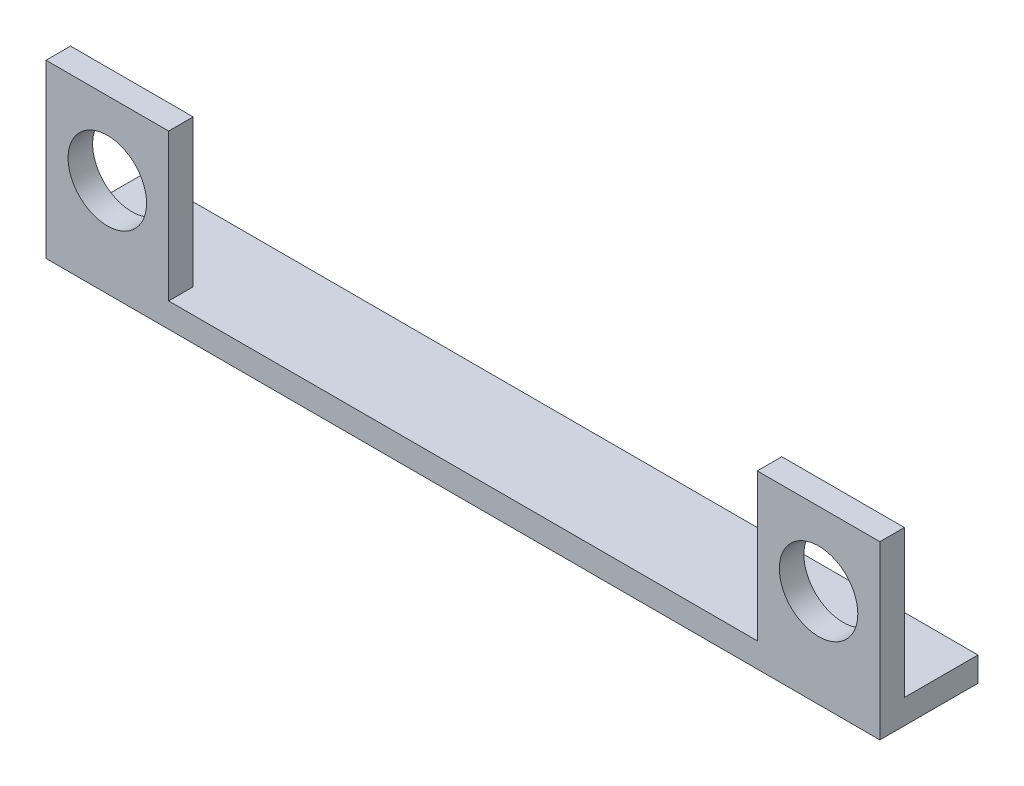
ISO-10303-21;
HEADER;
FILE_DESCRIPTION(('STEP AP214'),'2;1');
FILE_NAME('part.step','',(''),(''),'','','');
FILE_SCHEMA(('AUTOMOTIVE_DESIGN { 1 0 10303 214 1 1 1 1 }'));
ENDSEC;
DATA;
#1=APPLICATION_CONTEXT('core data for automotive mechanical design processes');
#2=APPLICATION_PROTOCOL_DEFINITION('international standard','automotive_design',2000,#1);
#3=PRODUCT_CONTEXT('',#1,'mechanical');
#4=PRODUCT('Part','Part','',(#3));
#5=PRODUCT_RELATED_PRODUCT_CATEGORY('part','',(#4));
#6=PRODUCT_DEFINITION_FORMATION('','',#4);
#7=PRODUCT_DEFINITION_CONTEXT('part definition',#1,'design');
#8=PRODUCT_DEFINITION('design','',#6,#7);
#9=PRODUCT_DEFINITION_SHAPE('','',#8);
#10=(LENGTH_UNIT() NAMED_UNIT(*) SI_UNIT(.MILLI.,.METRE.));
#11=(NAMED_UNIT(*) PLANE_ANGLE_UNIT() SI_UNIT($,.RADIAN.));
#12=(NAMED_UNIT(*) SI_UNIT($,.STERADIAN.) SOLID_ANGLE_UNIT());
#13=UNCERTAINTY_MEASURE_WITH_UNIT(LENGTH_MEASURE(1.E-05),#10,'distance_accuracy_value','');
#14=(GEOMETRIC_REPRESENTATION_CONTEXT(3) GLOBAL_UNCERTAINTY_ASSIGNED_CONTEXT((#13)) GLOBAL_UNIT_ASSIGNED_CONTEXT((#10,
#11,#12)) REPRESENTATION_CONTEXT('',''));
#15=CARTESIAN_POINT('',(0.,0.,0.));
#16=DIRECTION('',(0.,0.,1.));
#17=DIRECTION('',(1.,0.,0.));
#18=AXIS2_PLACEMENT_3D('',#15,#16,#17);
#19=CARTESIAN_POINT('',(0.,1.,0.));
#20=DIRECTION('',(0.,1.,0.));
#21=DIRECTION('',(0.,0.,1.));
#22=AXIS2_PLACEMENT_3D('',#19,#20,#21);
#23=PLANE('',#22);
#24=DIRECTION('',(0.,0.,1.));
#25=VECTOR('',#24,1.);
#26=CARTESIAN_POINT('',(12.,1.,2.));
#27=LINE('',#26,#25);
#28=CARTESIAN_POINT('',(12.,1.,1.));
#29=VERTEX_POINT('',#28);
#30=CARTESIAN_POINT('',(12.,1.,2.));
#31=VERTEX_POINT('',#30);
#32=EDGE_CURVE('E54',#29,#31,#27,.T.);
#33=ORIENTED_EDGE('',*,*,#32,.F.);
#34=DIRECTION('',(-1.,0.,0.));
#35=VECTOR('',#34,1.);
#36=CARTESIAN_POINT('',(17.,1.,1.));
#37=LINE('',#36,#35);
#38=CARTESIAN_POINT('',(17.,1.,1.));
#39=VERTEX_POINT('',#38);
#40=EDGE_CURVE('E58',#39,#29,#37,.T.);
#41=ORIENTED_EDGE('',*,*,#40,.F.);
#42=DIRECTION('',(0.,0.,-1.));
#43=VECTOR('',#42,1.);
#44=CARTESIAN_POINT('',(17.,1.,-2.));
#45=LINE('',#44,#43);
#46=CARTESIAN_POINT('',(17.,1.,-2.));
#47=VERTEX_POINT('',#46);
#48=EDGE_CURVE('E173',#39,#47,#45,.T.);
#49=ORIENTED_EDGE('',*,*,#48,.T.);
#50=DIRECTION('',(-1.,0.,0.));
#51=VECTOR('',#50,1.);
#52=CARTESIAN_POINT('',(-17.,1.,-2.));
#53=LINE('',#52,#51);
#54=CARTESIAN_POINT('',(-17.,1.,-2.));
#55=VERTEX_POINT('',#54);
#56=EDGE_CURVE('E175',#47,#55,#53,.T.);
#57=ORIENTED_EDGE('',*,*,#56,.T.);
#58=DIRECTION('',(0.,0.,1.));
#59=VECTOR('',#58,1.);
#60=CARTESIAN_POINT('',(-17.,1.,-2.));
#61=LINE('',#60,#59);
#62=CARTESIAN_POINT('',(-17.,1.,1.));
#63=VERTEX_POINT('',#62);
#64=EDGE_CURVE('E168',#55,#63,#61,.T.);
#65=ORIENTED_EDGE('',*,*,#64,.T.);
#66=DIRECTION('',(-1.,0.,0.));
#67=VECTOR('',#66,1.);
#68=CARTESIAN_POINT('',(-17.,1.,1.));
#69=LINE('',#68,#67);
#70=CARTESIAN_POINT('',(-12.,1.,1.));
#71=VERTEX_POINT('',#70);
#72=EDGE_CURVE('E147',#71,#63,#69,.T.);
#73=ORIENTED_EDGE('',*,*,#72,.F.);
#74=DIRECTION('',(0.,0.,-1.));
#75=VECTOR('',#74,1.);
#76=CARTESIAN_POINT('',(-12.,1.,2.));
#77=LINE('',#76,#75);
#78=CARTESIAN_POINT('',(-12.,1.,2.));
#79=VERTEX_POINT('',#78);
#80=EDGE_CURVE('E154',#79,#71,#77,.T.);
#81=ORIENTED_EDGE('',*,*,#80,.F.);
#82=DIRECTION('',(1.,0.,0.));
#83=VECTOR('',#82,1.);
#84=CARTESIAN_POINT('',(-17.,1.,2.));
#85=LINE('',#84,#83);
#86=EDGE_CURVE('E170',#79,#31,#85,.T.);
#87=ORIENTED_EDGE('',*,*,#86,.T.);
#88=EDGE_LOOP('',(#33,#41,#49,#57,#65,#73,#81,#87));
#89=FACE_BOUND('',#88,.T.);
#90=ADVANCED_FACE('F37',(#89),#23,.T.);
#91=CARTESIAN_POINT('',(-17.,1.,-2.));
#92=DIRECTION('',(1.,0.,0.));
#93=DIRECTION('',(0.,0.,-1.));
#94=AXIS2_PLACEMENT_3D('',#91,#92,#93);
#95=PLANE('',#94);
#96=DIRECTION('',(0.,0.,1.));
#97=VECTOR('',#96,1.);
#98=CARTESIAN_POINT('',(-17.,0.,-2.));
#99=LINE('',#98,#97);
#100=CARTESIAN_POINT('',(-17.,0.,-2.));
#101=VERTEX_POINT('',#100);
#102=CARTESIAN_POINT('',(-17.,0.,2.));
#103=VERTEX_POINT('',#102);
#104=EDGE_CURVE('E167',#101,#103,#99,.T.);
#105=ORIENTED_EDGE('',*,*,#104,.T.);
#106=DIRECTION('',(0.,-1.,0.));
#107=VECTOR('',#106,1.);
#108=CARTESIAN_POINT('',(-17.,1.,2.));
#109=LINE('',#108,#107);
#110=CARTESIAN_POINT('',(-17.,7.,2.));
#111=VERTEX_POINT('',#110);
#112=EDGE_CURVE('E11',#111,#103,#109,.T.);
#113=ORIENTED_EDGE('',*,*,#112,.F.);
#114=DIRECTION('',(0.,0.,1.));
#115=VECTOR('',#114,1.);
#116=CARTESIAN_POINT('',(-17.,7.,2.));
#117=LINE('',#116,#115);
#118=CARTESIAN_POINT('',(-17.,7.,1.));
#119=VERTEX_POINT('',#118);
#120=EDGE_CURVE('E143',#119,#111,#117,.T.);
#121=ORIENTED_EDGE('',*,*,#120,.F.);
#122=DIRECTION('',(0.,-1.,0.));
#123=VECTOR('',#122,1.);
#124=CARTESIAN_POINT('',(-17.,7.,1.));
#125=LINE('',#124,#123);
#126=EDGE_CURVE('E153',#119,#63,#125,.T.);
#127=ORIENTED_EDGE('',*,*,#126,.T.);
#128=ORIENTED_EDGE('',*,*,#64,.F.);
#129=DIRECTION('',(0.,-1.,0.));
#130=VECTOR('',#129,1.);
#131=CARTESIAN_POINT('',(-17.,1.,-2.));
#132=LINE('',#131,#130);
#133=EDGE_CURVE('E177',#55,#101,#132,.T.);
#134=ORIENTED_EDGE('',*,*,#133,.T.);
#135=EDGE_LOOP('',(#105,#113,#121,#127,#128,#134));
#136=FACE_BOUND('',#135,.T.);
#137=ADVANCED_FACE('F39',(#136),#95,.F.);
#138=CARTESIAN_POINT('',(-17.,1.,2.));
#139=DIRECTION('',(0.,0.,-1.));
#140=DIRECTION('',(-1.,0.,0.));
#141=AXIS2_PLACEMENT_3D('',#138,#139,#140);
#142=PLANE('',#141);
#143=CARTESIAN_POINT('',(-14.5,4.,2.));
#144=DIRECTION('',(0.,0.,1.));
#145=DIRECTION('',(1.,0.,0.));
#146=AXIS2_PLACEMENT_3D('',#143,#144,#145);
#147=CIRCLE('',#146,1.6);
#148=CARTESIAN_POINT('',(-12.9,4.,2.));
#149=VERTEX_POINT('',#148);
#150=EDGE_CURVE('E189',#149,#149,#147,.T.);
#151=ORIENTED_EDGE('',*,*,#150,.F.);
#152=EDGE_LOOP('',(#151));
#153=FACE_BOUND('',#152,.T.);
#154=CARTESIAN_POINT('',(14.5,4.,2.));
#155=DIRECTION('',(0.,0.,1.));
#156=DIRECTION('',(1.,0.,0.));
#157=AXIS2_PLACEMENT_3D('',#154,#155,#156);
#158=CIRCLE('',#157,1.6);
#159=CARTESIAN_POINT('',(16.1,4.,2.));
#160=VERTEX_POINT('',#159);
#161=EDGE_CURVE('E194',#160,#160,#158,.T.);
#162=ORIENTED_EDGE('',*,*,#161,.F.);
#163=EDGE_LOOP('',(#162));
#164=FACE_BOUND('',#163,.T.);
#165=DIRECTION('',(1.,0.,0.));
#166=VECTOR('',#165,1.);
#167=CARTESIAN_POINT('',(-17.,0.,2.));
#168=LINE('',#167,#166);
#169=CARTESIAN_POINT('',(17.,0.,2.));
#170=VERTEX_POINT('',#169);
#171=EDGE_CURVE('E118',#103,#170,#168,.T.);
#172=ORIENTED_EDGE('',*,*,#171,.T.);
#173=DIRECTION('',(0.,-1.,0.));
#174=VECTOR('',#173,1.);
#175=CARTESIAN_POINT('',(17.,1.,2.));
#176=LINE('',#175,#174);
#177=CARTESIAN_POINT('',(17.,7.,2.));
#178=VERTEX_POINT('',#177);
#179=EDGE_CURVE('E46',#178,#170,#176,.T.);
#180=ORIENTED_EDGE('',*,*,#179,.F.);
#181=DIRECTION('',(1.,0.,0.));
#182=VECTOR('',#181,1.);
#183=CARTESIAN_POINT('',(17.,7.,2.));
#184=LINE('',#183,#182);
#185=CARTESIAN_POINT('',(12.,7.,2.));
#186=VERTEX_POINT('',#185);
#187=EDGE_CURVE('E117',#186,#178,#184,.T.);
#188=ORIENTED_EDGE('',*,*,#187,.F.);
#189=DIRECTION('',(0.,-1.,0.));
#190=VECTOR('',#189,1.);
#191=CARTESIAN_POINT('',(12.,7.,2.));
#192=LINE('',#191,#190);
#193=EDGE_CURVE('E132',#186,#31,#192,.T.);
#194=ORIENTED_EDGE('',*,*,#193,.T.);
#195=ORIENTED_EDGE('',*,*,#86,.F.);
#196=DIRECTION('',(0.,-1.,0.));
#197=VECTOR('',#196,1.);
#198=CARTESIAN_POINT('',(-12.,7.,2.));
#199=LINE('',#198,#197);
#200=CARTESIAN_POINT('',(-12.,7.,2.));
#201=VERTEX_POINT('',#200);
#202=EDGE_CURVE('E164',#201,#79,#199,.T.);
#203=ORIENTED_EDGE('',*,*,#202,.F.);
#204=DIRECTION('',(1.,0.,0.));
#205=VECTOR('',#204,1.);
#206=CARTESIAN_POINT('',(-17.,7.,2.));
#207=LINE('',#206,#205);
#208=EDGE_CURVE('E146',#111,#201,#207,.T.);
#209=ORIENTED_EDGE('',*,*,#208,.F.);
#210=ORIENTED_EDGE('',*,*,#112,.T.);
#211=EDGE_LOOP('',(#172,#180,#188,#194,#195,#203,#209,#210));
#212=FACE_BOUND('',#211,.T.);
#213=ADVANCED_FACE('F115',(#153,#164,#212),#142,.F.);
#214=CARTESIAN_POINT('',(17.,1.,-2.));
#215=DIRECTION('',(-1.,0.,0.));
#216=DIRECTION('',(0.,0.,1.));
#217=AXIS2_PLACEMENT_3D('',#214,#215,#216);
#218=PLANE('',#217);
#219=DIRECTION('',(0.,0.,-1.));
#220=VECTOR('',#219,1.);
#221=CARTESIAN_POINT('',(17.,0.,-2.));
#222=LINE('',#221,#220);
#223=CARTESIAN_POINT('',(17.,0.,-2.));
#224=VERTEX_POINT('',#223);
#225=EDGE_CURVE('E181',#170,#224,#222,.T.);
#226=ORIENTED_EDGE('',*,*,#225,.T.);
#227=DIRECTION('',(0.,-1.,0.));
#228=VECTOR('',#227,1.);
#229=CARTESIAN_POINT('',(17.,1.,-2.));
#230=LINE('',#229,#228);
#231=EDGE_CURVE('E122',#47,#224,#230,.T.);
#232=ORIENTED_EDGE('',*,*,#231,.F.);
#233=ORIENTED_EDGE('',*,*,#48,.F.);
#234=DIRECTION('',(0.,-1.,0.));
#235=VECTOR('',#234,1.);
#236=CARTESIAN_POINT('',(17.,7.,1.));
#237=LINE('',#236,#235);
#238=CARTESIAN_POINT('',(17.,7.,1.));
#239=VERTEX_POINT('',#238);
#240=EDGE_CURVE('E136',#239,#39,#237,.T.);
#241=ORIENTED_EDGE('',*,*,#240,.F.);
#242=DIRECTION('',(0.,0.,-1.));
#243=VECTOR('',#242,1.);
#244=CARTESIAN_POINT('',(17.,7.,2.));
#245=LINE('',#244,#243);
#246=EDGE_CURVE('E127',#178,#239,#245,.T.);
#247=ORIENTED_EDGE('',*,*,#246,.F.);
#248=ORIENTED_EDGE('',*,*,#179,.T.);
#249=EDGE_LOOP('',(#226,#232,#233,#241,#247,#248));
#250=FACE_BOUND('',#249,.T.);
#251=ADVANCED_FACE('F134',(#250),#218,.F.);
#252=CARTESIAN_POINT('',(-17.,1.,-2.));
#253=DIRECTION('',(0.,0.,1.));
#254=DIRECTION('',(1.,0.,0.));
#255=AXIS2_PLACEMENT_3D('',#252,#253,#254);
#256=PLANE('',#255);
#257=DIRECTION('',(-1.,0.,0.));
#258=VECTOR('',#257,1.);
#259=CARTESIAN_POINT('',(-17.,0.,-2.));
#260=LINE('',#259,#258);
#261=EDGE_CURVE('E171',#224,#101,#260,.T.);
#262=ORIENTED_EDGE('',*,*,#261,.T.);
#263=ORIENTED_EDGE('',*,*,#133,.F.);
#264=ORIENTED_EDGE('',*,*,#56,.F.);
#265=ORIENTED_EDGE('',*,*,#231,.T.);
#266=EDGE_LOOP('',(#262,#263,#264,#265));
#267=FACE_BOUND('',#266,.T.);
#268=ADVANCED_FACE('F233',(#267),#256,.F.);
#269=CARTESIAN_POINT('',(0.,0.,0.));
#270=DIRECTION('',(0.,1.,0.));
#271=DIRECTION('',(0.,0.,1.));
#272=AXIS2_PLACEMENT_3D('',#269,#270,#271);
#273=PLANE('',#272);
#274=ORIENTED_EDGE('',*,*,#104,.F.);
#275=ORIENTED_EDGE('',*,*,#261,.F.);
#276=ORIENTED_EDGE('',*,*,#225,.F.);
#277=ORIENTED_EDGE('',*,*,#171,.F.);
#278=EDGE_LOOP('',(#274,#275,#276,#277));
#279=FACE_BOUND('',#278,.T.);
#280=ADVANCED_FACE('F229',(#279),#273,.F.);
#281=CARTESIAN_POINT('',(-12.,7.,2.));
#282=DIRECTION('',(-1.,0.,0.));
#283=DIRECTION('',(0.,0.,1.));
#284=AXIS2_PLACEMENT_3D('',#281,#282,#283);
#285=PLANE('',#284);
#286=ORIENTED_EDGE('',*,*,#80,.T.);
#287=DIRECTION('',(0.,-1.,0.));
#288=VECTOR('',#287,1.);
#289=CARTESIAN_POINT('',(-12.,7.,1.));
#290=LINE('',#289,#288);
#291=CARTESIAN_POINT('',(-12.,7.,1.));
#292=VERTEX_POINT('',#291);
#293=EDGE_CURVE('E161',#292,#71,#290,.T.);
#294=ORIENTED_EDGE('',*,*,#293,.F.);
#295=DIRECTION('',(0.,0.,-1.));
#296=VECTOR('',#295,1.);
#297=CARTESIAN_POINT('',(-12.,7.,2.));
#298=LINE('',#297,#296);
#299=EDGE_CURVE('E149',#201,#292,#298,.T.);
#300=ORIENTED_EDGE('',*,*,#299,.F.);
#301=ORIENTED_EDGE('',*,*,#202,.T.);
#302=EDGE_LOOP('',(#286,#294,#300,#301));
#303=FACE_BOUND('',#302,.T.);
#304=ADVANCED_FACE('F216',(#303),#285,.F.);
#305=CARTESIAN_POINT('',(-17.,7.,1.));
#306=DIRECTION('',(0.,0.,1.));
#307=DIRECTION('',(1.,0.,0.));
#308=AXIS2_PLACEMENT_3D('',#305,#306,#307);
#309=PLANE('',#308);
#310=CARTESIAN_POINT('',(-14.5,4.,1.));
#311=DIRECTION('',(0.,0.,1.));
#312=DIRECTION('',(1.,0.,0.));
#313=AXIS2_PLACEMENT_3D('',#310,#311,#312);
#314=CIRCLE('',#313,1.6);
#315=CARTESIAN_POINT('',(-12.9,4.,1.));
#316=VERTEX_POINT('',#315);
#317=EDGE_CURVE('E41',#316,#316,#314,.T.);
#318=ORIENTED_EDGE('',*,*,#317,.T.);
#319=EDGE_LOOP('',(#318));
#320=FACE_BOUND('',#319,.T.);
#321=ORIENTED_EDGE('',*,*,#72,.T.);
#322=ORIENTED_EDGE('',*,*,#126,.F.);
#323=DIRECTION('',(-1.,0.,0.));
#324=VECTOR('',#323,1.);
#325=CARTESIAN_POINT('',(-17.,7.,1.));
#326=LINE('',#325,#324);
#327=EDGE_CURVE('E151',#292,#119,#326,.T.);
#328=ORIENTED_EDGE('',*,*,#327,.F.);
#329=ORIENTED_EDGE('',*,*,#293,.T.);
#330=EDGE_LOOP('',(#321,#322,#328,#329));
#331=FACE_BOUND('',#330,.T.);
#332=ADVANCED_FACE('F235',(#320,#331),#309,.F.);
#333=CARTESIAN_POINT('',(0.,7.,0.));
#334=DIRECTION('',(0.,-1.,0.));
#335=DIRECTION('',(0.,0.,-1.));
#336=AXIS2_PLACEMENT_3D('',#333,#334,#335);
#337=PLANE('',#336);
#338=ORIENTED_EDGE('',*,*,#120,.T.);
#339=ORIENTED_EDGE('',*,*,#208,.T.);
#340=ORIENTED_EDGE('',*,*,#299,.T.);
#341=ORIENTED_EDGE('',*,*,#327,.T.);
#342=EDGE_LOOP('',(#338,#339,#340,#341));
#343=FACE_BOUND('',#342,.T.);
#344=ADVANCED_FACE('F220',(#343),#337,.F.);
#345=CARTESIAN_POINT('',(17.,7.,1.));
#346=DIRECTION('',(0.,0.,1.));
#347=DIRECTION('',(1.,0.,0.));
#348=AXIS2_PLACEMENT_3D('',#345,#346,#347);
#349=PLANE('',#348);
#350=CARTESIAN_POINT('',(14.5,4.,1.));
#351=DIRECTION('',(0.,0.,1.));
#352=DIRECTION('',(1.,0.,0.));
#353=AXIS2_PLACEMENT_3D('',#350,#351,#352);
#354=CIRCLE('',#353,1.6);
#355=CARTESIAN_POINT('',(16.1,4.,1.));
#356=VERTEX_POINT('',#355);
#357=EDGE_CURVE('E187',#356,#356,#354,.T.);
#358=ORIENTED_EDGE('',*,*,#357,.T.);
#359=EDGE_LOOP('',(#358));
#360=FACE_BOUND('',#359,.T.);
#361=ORIENTED_EDGE('',*,*,#40,.T.);
#362=DIRECTION('',(0.,-1.,0.));
#363=VECTOR('',#362,1.);
#364=CARTESIAN_POINT('',(12.,7.,1.));
#365=LINE('',#364,#363);
#366=CARTESIAN_POINT('',(12.,7.,1.));
#367=VERTEX_POINT('',#366);
#368=EDGE_CURVE('E202',#367,#29,#365,.T.);
#369=ORIENTED_EDGE('',*,*,#368,.F.);
#370=DIRECTION('',(-1.,0.,0.));
#371=VECTOR('',#370,1.);
#372=CARTESIAN_POINT('',(17.,7.,1.));
#373=LINE('',#372,#371);
#374=EDGE_CURVE('E137',#239,#367,#373,.T.);
#375=ORIENTED_EDGE('',*,*,#374,.F.);
#376=ORIENTED_EDGE('',*,*,#240,.T.);
#377=EDGE_LOOP('',(#361,#369,#375,#376));
#378=FACE_BOUND('',#377,.T.);
#379=ADVANCED_FACE('F208',(#360,#378),#349,.F.);
#380=CARTESIAN_POINT('',(12.,7.,2.));
#381=DIRECTION('',(1.,0.,0.));
#382=DIRECTION('',(0.,0.,-1.));
#383=AXIS2_PLACEMENT_3D('',#380,#381,#382);
#384=PLANE('',#383);
#385=ORIENTED_EDGE('',*,*,#32,.T.);
#386=ORIENTED_EDGE('',*,*,#193,.F.);
#387=DIRECTION('',(0.,0.,1.));
#388=VECTOR('',#387,1.);
#389=CARTESIAN_POINT('',(12.,7.,2.));
#390=LINE('',#389,#388);
#391=EDGE_CURVE('E130',#367,#186,#390,.T.);
#392=ORIENTED_EDGE('',*,*,#391,.F.);
#393=ORIENTED_EDGE('',*,*,#368,.T.);
#394=EDGE_LOOP('',(#385,#386,#392,#393));
#395=FACE_BOUND('',#394,.T.);
#396=ADVANCED_FACE('F210',(#395),#384,.F.);
#397=CARTESIAN_POINT('',(0.,7.,0.));
#398=DIRECTION('',(0.,1.,0.));
#399=DIRECTION('',(0.,0.,1.));
#400=AXIS2_PLACEMENT_3D('',#397,#398,#399);
#401=PLANE('',#400);
#402=ORIENTED_EDGE('',*,*,#246,.T.);
#403=ORIENTED_EDGE('',*,*,#374,.T.);
#404=ORIENTED_EDGE('',*,*,#391,.T.);
#405=ORIENTED_EDGE('',*,*,#187,.T.);
#406=EDGE_LOOP('',(#402,#403,#404,#405));
#407=FACE_BOUND('',#406,.T.);
#408=ADVANCED_FACE('F126',(#407),#401,.T.);
#409=CARTESIAN_POINT('',(14.5,4.,-4.));
#410=DIRECTION('',(0.,0.,1.));
#411=DIRECTION('',(1.,0.,0.));
#412=AXIS2_PLACEMENT_3D('',#409,#410,#411);
#413=CYLINDRICAL_SURFACE('',#412,1.6);
#414=ORIENTED_EDGE('',*,*,#161,.T.);
#415=EDGE_LOOP('',(#414));
#416=FACE_BOUND('',#415,.T.);
#417=ORIENTED_EDGE('',*,*,#357,.F.);
#418=EDGE_LOOP('',(#417));
#419=FACE_BOUND('',#418,.T.);
#420=ADVANCED_FACE('F263',(#416,#419),#413,.F.);
#421=CARTESIAN_POINT('',(-14.5,4.,-4.));
#422=DIRECTION('',(0.,0.,1.));
#423=DIRECTION('',(1.,0.,0.));
#424=AXIS2_PLACEMENT_3D('',#421,#422,#423);
#425=CYLINDRICAL_SURFACE('',#424,1.6);
#426=ORIENTED_EDGE('',*,*,#150,.T.);
#427=EDGE_LOOP('',(#426));
#428=FACE_BOUND('',#427,.T.);
#429=ORIENTED_EDGE('',*,*,#317,.F.);
#430=EDGE_LOOP('',(#429));
#431=FACE_BOUND('',#430,.T.);
#432=ADVANCED_FACE('F266',(#428,#431),#425,.F.);
#433=CLOSED_SHELL('',(#90,#137,#213,#251,#268,#280,#304,#332,#344,#379,#396,#408,#420,#432));
#434=MANIFOLD_SOLID_BREP('B2',#433);
#435=ADVANCED_BREP_SHAPE_REPRESENTATION('',(#18,#434),#14);
#436=SHAPE_DEFINITION_REPRESENTATION(#9,#435);
ENDSEC;
END-ISO-10303-21;
